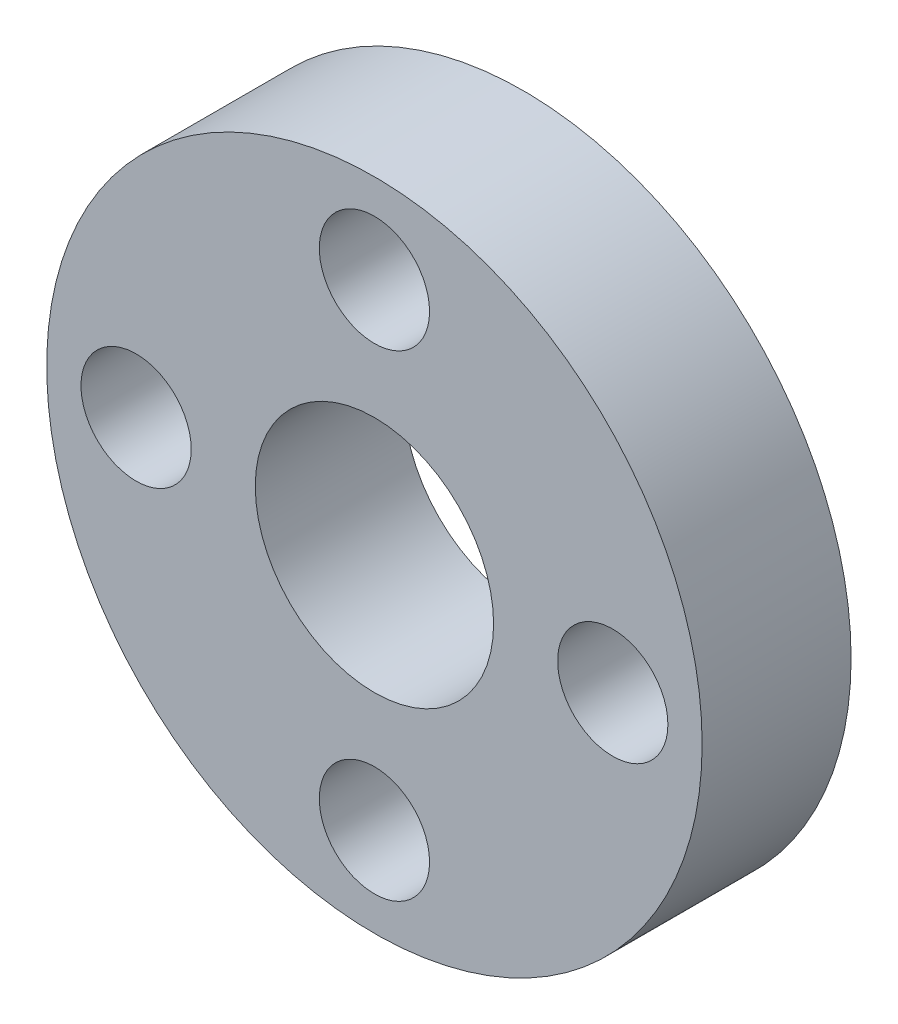
ISO-10303-21;
HEADER;
FILE_DESCRIPTION(('STEP AP214'),'2;1');
FILE_NAME('part.step','',(''),(''),'','','');
FILE_SCHEMA(('AUTOMOTIVE_DESIGN { 1 0 10303 214 1 1 1 1 }'));
ENDSEC;
DATA;
#1=APPLICATION_CONTEXT('core data for automotive mechanical design processes');
#2=APPLICATION_PROTOCOL_DEFINITION('international standard','automotive_design',2000,#1);
#3=PRODUCT_CONTEXT('',#1,'mechanical');
#4=PRODUCT('Part','Part','',(#3));
#5=PRODUCT_RELATED_PRODUCT_CATEGORY('part','',(#4));
#6=PRODUCT_DEFINITION_FORMATION('','',#4);
#7=PRODUCT_DEFINITION_CONTEXT('part definition',#1,'design');
#8=PRODUCT_DEFINITION('design','',#6,#7);
#9=PRODUCT_DEFINITION_SHAPE('','',#8);
#10=(LENGTH_UNIT() NAMED_UNIT(*) SI_UNIT(.MILLI.,.METRE.));
#11=(NAMED_UNIT(*) PLANE_ANGLE_UNIT() SI_UNIT($,.RADIAN.));
#12=(NAMED_UNIT(*) SI_UNIT($,.STERADIAN.) SOLID_ANGLE_UNIT());
#13=UNCERTAINTY_MEASURE_WITH_UNIT(LENGTH_MEASURE(1.E-05),#10,'distance_accuracy_value','');
#14=(GEOMETRIC_REPRESENTATION_CONTEXT(3) GLOBAL_UNCERTAINTY_ASSIGNED_CONTEXT((#13)) GLOBAL_UNIT_ASSIGNED_CONTEXT((#10,
#11,#12)) REPRESENTATION_CONTEXT('',''));
#15=CARTESIAN_POINT('',(0.,0.,0.));
#16=DIRECTION('',(0.,0.,1.));
#17=DIRECTION('',(1.,0.,0.));
#18=AXIS2_PLACEMENT_3D('',#15,#16,#17);
#19=CARTESIAN_POINT('',(0.,0.,5.));
#20=DIRECTION('',(0.,0.,-1.));
#21=DIRECTION('',(-1.,0.,0.));
#22=AXIS2_PLACEMENT_3D('',#19,#20,#21);
#23=CYLINDRICAL_SURFACE('',#22,4.);
#24=CARTESIAN_POINT('',(0.,0.,5.));
#25=DIRECTION('',(0.,0.,1.));
#26=DIRECTION('',(1.,0.,0.));
#27=AXIS2_PLACEMENT_3D('',#24,#25,#26);
#28=CIRCLE('',#27,4.);
#29=CARTESIAN_POINT('',(4.,0.,5.));
#30=VERTEX_POINT('',#29);
#31=EDGE_CURVE('E39',#30,#30,#28,.T.);
#32=ORIENTED_EDGE('',*,*,#31,.T.);
#33=EDGE_LOOP('',(#32));
#34=FACE_BOUND('',#33,.T.);
#35=CARTESIAN_POINT('',(0.,0.,0.));
#36=DIRECTION('',(0.,0.,1.));
#37=DIRECTION('',(1.,0.,0.));
#38=AXIS2_PLACEMENT_3D('',#35,#36,#37);
#39=CIRCLE('',#38,4.);
#40=CARTESIAN_POINT('',(4.,0.,0.));
#41=VERTEX_POINT('',#40);
#42=EDGE_CURVE('E59',#41,#41,#39,.T.);
#43=ORIENTED_EDGE('',*,*,#42,.F.);
#44=EDGE_LOOP('',(#43));
#45=FACE_BOUND('',#44,.T.);
#46=ADVANCED_FACE('F31',(#34,#45),#23,.F.);
#47=CARTESIAN_POINT('',(0.,8.,5.));
#48=DIRECTION('',(0.,0.,-1.));
#49=DIRECTION('',(-1.,0.,0.));
#50=AXIS2_PLACEMENT_3D('',#47,#48,#49);
#51=CYLINDRICAL_SURFACE('',#50,1.85);
#52=CARTESIAN_POINT('',(0.,8.,5.));
#53=DIRECTION('',(0.,0.,1.));
#54=DIRECTION('',(1.,0.,0.));
#55=AXIS2_PLACEMENT_3D('',#52,#53,#54);
#56=CIRCLE('',#55,1.85);
#57=CARTESIAN_POINT('',(1.85,8.,5.));
#58=VERTEX_POINT('',#57);
#59=EDGE_CURVE('E44',#58,#58,#56,.T.);
#60=ORIENTED_EDGE('',*,*,#59,.T.);
#61=EDGE_LOOP('',(#60));
#62=FACE_BOUND('',#61,.T.);
#63=CARTESIAN_POINT('',(0.,8.,0.));
#64=DIRECTION('',(0.,0.,1.));
#65=DIRECTION('',(1.,0.,0.));
#66=AXIS2_PLACEMENT_3D('',#63,#64,#65);
#67=CIRCLE('',#66,1.85);
#68=CARTESIAN_POINT('',(1.85,8.,0.));
#69=VERTEX_POINT('',#68);
#70=EDGE_CURVE('E57',#69,#69,#67,.T.);
#71=ORIENTED_EDGE('',*,*,#70,.F.);
#72=EDGE_LOOP('',(#71));
#73=FACE_BOUND('',#72,.T.);
#74=ADVANCED_FACE('F80',(#62,#73),#51,.F.);
#75=CARTESIAN_POINT('',(8.,0.,5.));
#76=DIRECTION('',(0.,0.,-1.));
#77=DIRECTION('',(-1.,0.,0.));
#78=AXIS2_PLACEMENT_3D('',#75,#76,#77);
#79=CYLINDRICAL_SURFACE('',#78,1.85);
#80=CARTESIAN_POINT('',(8.,0.,5.));
#81=DIRECTION('',(0.,0.,1.));
#82=DIRECTION('',(1.,0.,0.));
#83=AXIS2_PLACEMENT_3D('',#80,#81,#82);
#84=CIRCLE('',#83,1.85);
#85=CARTESIAN_POINT('',(9.85,0.,5.));
#86=VERTEX_POINT('',#85);
#87=EDGE_CURVE('E73',#86,#86,#84,.T.);
#88=ORIENTED_EDGE('',*,*,#87,.T.);
#89=EDGE_LOOP('',(#88));
#90=FACE_BOUND('',#89,.T.);
#91=CARTESIAN_POINT('',(8.,0.,0.));
#92=DIRECTION('',(0.,0.,1.));
#93=DIRECTION('',(1.,0.,0.));
#94=AXIS2_PLACEMENT_3D('',#91,#92,#93);
#95=CIRCLE('',#94,1.85);
#96=CARTESIAN_POINT('',(9.85,0.,0.));
#97=VERTEX_POINT('',#96);
#98=EDGE_CURVE('E54',#97,#97,#95,.T.);
#99=ORIENTED_EDGE('',*,*,#98,.F.);
#100=EDGE_LOOP('',(#99));
#101=FACE_BOUND('',#100,.T.);
#102=ADVANCED_FACE('F98',(#90,#101),#79,.F.);
#103=CARTESIAN_POINT('',(0.,-8.,5.));
#104=DIRECTION('',(0.,0.,-1.));
#105=DIRECTION('',(-1.,0.,0.));
#106=AXIS2_PLACEMENT_3D('',#103,#104,#105);
#107=CYLINDRICAL_SURFACE('',#106,1.85);
#108=CARTESIAN_POINT('',(0.,-8.,5.));
#109=DIRECTION('',(0.,0.,1.));
#110=DIRECTION('',(1.,0.,0.));
#111=AXIS2_PLACEMENT_3D('',#108,#109,#110);
#112=CIRCLE('',#111,1.85);
#113=CARTESIAN_POINT('',(1.84999999999994,-8.,5.));
#114=VERTEX_POINT('',#113);
#115=EDGE_CURVE('E68',#114,#114,#112,.T.);
#116=ORIENTED_EDGE('',*,*,#115,.T.);
#117=EDGE_LOOP('',(#116));
#118=FACE_BOUND('',#117,.T.);
#119=CARTESIAN_POINT('',(0.,-8.,0.));
#120=DIRECTION('',(0.,0.,1.));
#121=DIRECTION('',(1.,0.,0.));
#122=AXIS2_PLACEMENT_3D('',#119,#120,#121);
#123=CIRCLE('',#122,1.85);
#124=CARTESIAN_POINT('',(1.84999999999994,-8.,0.));
#125=VERTEX_POINT('',#124);
#126=EDGE_CURVE('E51',#125,#125,#123,.T.);
#127=ORIENTED_EDGE('',*,*,#126,.F.);
#128=EDGE_LOOP('',(#127));
#129=FACE_BOUND('',#128,.T.);
#130=ADVANCED_FACE('F104',(#118,#129),#107,.F.);
#131=CARTESIAN_POINT('',(-8.,0.,5.));
#132=DIRECTION('',(0.,0.,-1.));
#133=DIRECTION('',(-1.,0.,0.));
#134=AXIS2_PLACEMENT_3D('',#131,#132,#133);
#135=CYLINDRICAL_SURFACE('',#134,1.85);
#136=CARTESIAN_POINT('',(-8.,0.,5.));
#137=DIRECTION('',(0.,0.,1.));
#138=DIRECTION('',(1.,0.,0.));
#139=AXIS2_PLACEMENT_3D('',#136,#137,#138);
#140=CIRCLE('',#139,1.85);
#141=CARTESIAN_POINT('',(-6.15,0.,5.));
#142=VERTEX_POINT('',#141);
#143=EDGE_CURVE('E64',#142,#142,#140,.T.);
#144=ORIENTED_EDGE('',*,*,#143,.T.);
#145=EDGE_LOOP('',(#144));
#146=FACE_BOUND('',#145,.T.);
#147=CARTESIAN_POINT('',(-8.,0.,0.));
#148=DIRECTION('',(0.,0.,1.));
#149=DIRECTION('',(1.,0.,0.));
#150=AXIS2_PLACEMENT_3D('',#147,#148,#149);
#151=CIRCLE('',#150,1.85);
#152=CARTESIAN_POINT('',(-6.15,0.,0.));
#153=VERTEX_POINT('',#152);
#154=EDGE_CURVE('E48',#153,#153,#151,.T.);
#155=ORIENTED_EDGE('',*,*,#154,.F.);
#156=EDGE_LOOP('',(#155));
#157=FACE_BOUND('',#156,.T.);
#158=ADVANCED_FACE('F33',(#146,#157),#135,.F.);
#159=CARTESIAN_POINT('',(0.,0.,5.));
#160=DIRECTION('',(0.,0.,-1.));
#161=DIRECTION('',(-1.,0.,0.));
#162=AXIS2_PLACEMENT_3D('',#159,#160,#161);
#163=CYLINDRICAL_SURFACE('',#162,11.);
#164=CARTESIAN_POINT('',(0.,0.,5.));
#165=DIRECTION('',(0.,0.,1.));
#166=DIRECTION('',(1.,0.,0.));
#167=AXIS2_PLACEMENT_3D('',#164,#165,#166);
#168=CIRCLE('',#167,11.);
#169=CARTESIAN_POINT('',(11.,0.,5.));
#170=VERTEX_POINT('',#169);
#171=EDGE_CURVE('E10',#170,#170,#168,.T.);
#172=ORIENTED_EDGE('',*,*,#171,.F.);
#173=EDGE_LOOP('',(#172));
#174=FACE_BOUND('',#173,.T.);
#175=CARTESIAN_POINT('',(0.,0.,0.));
#176=DIRECTION('',(0.,0.,1.));
#177=DIRECTION('',(1.,0.,0.));
#178=AXIS2_PLACEMENT_3D('',#175,#176,#177);
#179=CIRCLE('',#178,11.);
#180=CARTESIAN_POINT('',(11.,0.,0.));
#181=VERTEX_POINT('',#180);
#182=EDGE_CURVE('E35',#181,#181,#179,.T.);
#183=ORIENTED_EDGE('',*,*,#182,.T.);
#184=EDGE_LOOP('',(#183));
#185=FACE_BOUND('',#184,.T.);
#186=ADVANCED_FACE('F87',(#174,#185),#163,.T.);
#187=CARTESIAN_POINT('',(0.,0.,5.));
#188=DIRECTION('',(0.,0.,1.));
#189=DIRECTION('',(1.,0.,0.));
#190=AXIS2_PLACEMENT_3D('',#187,#188,#189);
#191=PLANE('',#190);
#192=ORIENTED_EDGE('',*,*,#143,.F.);
#193=EDGE_LOOP('',(#192));
#194=FACE_BOUND('',#193,.T.);
#195=ORIENTED_EDGE('',*,*,#115,.F.);
#196=EDGE_LOOP('',(#195));
#197=FACE_BOUND('',#196,.T.);
#198=ORIENTED_EDGE('',*,*,#87,.F.);
#199=EDGE_LOOP('',(#198));
#200=FACE_BOUND('',#199,.T.);
#201=ORIENTED_EDGE('',*,*,#59,.F.);
#202=EDGE_LOOP('',(#201));
#203=FACE_BOUND('',#202,.T.);
#204=ORIENTED_EDGE('',*,*,#31,.F.);
#205=EDGE_LOOP('',(#204));
#206=FACE_BOUND('',#205,.T.);
#207=ORIENTED_EDGE('',*,*,#171,.T.);
#208=EDGE_LOOP('',(#207));
#209=FACE_BOUND('',#208,.T.);
#210=ADVANCED_FACE('F83',(#194,#197,#200,#203,#206,#209),#191,.T.);
#211=CARTESIAN_POINT('',(0.,0.,0.));
#212=DIRECTION('',(0.,0.,1.));
#213=DIRECTION('',(1.,0.,0.));
#214=AXIS2_PLACEMENT_3D('',#211,#212,#213);
#215=PLANE('',#214);
#216=ORIENTED_EDGE('',*,*,#154,.T.);
#217=EDGE_LOOP('',(#216));
#218=FACE_BOUND('',#217,.T.);
#219=ORIENTED_EDGE('',*,*,#126,.T.);
#220=EDGE_LOOP('',(#219));
#221=FACE_BOUND('',#220,.T.);
#222=ORIENTED_EDGE('',*,*,#98,.T.);
#223=EDGE_LOOP('',(#222));
#224=FACE_BOUND('',#223,.T.);
#225=ORIENTED_EDGE('',*,*,#70,.T.);
#226=EDGE_LOOP('',(#225));
#227=FACE_BOUND('',#226,.T.);
#228=ORIENTED_EDGE('',*,*,#42,.T.);
#229=EDGE_LOOP('',(#228));
#230=FACE_BOUND('',#229,.T.);
#231=ORIENTED_EDGE('',*,*,#182,.F.);
#232=EDGE_LOOP('',(#231));
#233=FACE_BOUND('',#232,.T.);
#234=ADVANCED_FACE('F86',(#218,#221,#224,#227,#230,#233),#215,.F.);
#235=CLOSED_SHELL('',(#46,#74,#102,#130,#158,#186,#210,#234));
#236=MANIFOLD_SOLID_BREP('B2',#235);
#237=ADVANCED_BREP_SHAPE_REPRESENTATION('',(#18,#236),#14);
#238=SHAPE_DEFINITION_REPRESENTATION(#9,#237);
ENDSEC;
END-ISO-10303-21;
